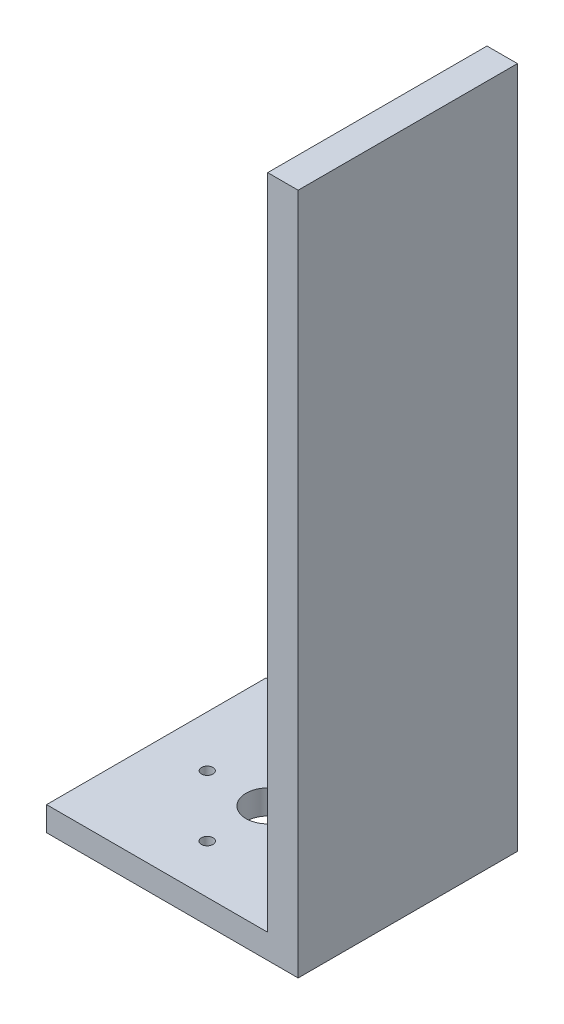
ISO-10303-21;
HEADER;
FILE_DESCRIPTION(('STEP AP214'),'2;1');
FILE_NAME('part.step','',(''),(''),'','','');
FILE_SCHEMA(('AUTOMOTIVE_DESIGN { 1 0 10303 214 1 1 1 1 }'));
ENDSEC;
DATA;
#1=APPLICATION_CONTEXT('core data for automotive mechanical design processes');
#2=APPLICATION_PROTOCOL_DEFINITION('international standard','automotive_design',2000,#1);
#3=PRODUCT_CONTEXT('',#1,'mechanical');
#4=PRODUCT('Part','Part','',(#3));
#5=PRODUCT_RELATED_PRODUCT_CATEGORY('part','',(#4));
#6=PRODUCT_DEFINITION_FORMATION('','',#4);
#7=PRODUCT_DEFINITION_CONTEXT('part definition',#1,'design');
#8=PRODUCT_DEFINITION('design','',#6,#7);
#9=PRODUCT_DEFINITION_SHAPE('','',#8);
#10=(LENGTH_UNIT() NAMED_UNIT(*) SI_UNIT(.MILLI.,.METRE.));
#11=(NAMED_UNIT(*) PLANE_ANGLE_UNIT() SI_UNIT($,.RADIAN.));
#12=(NAMED_UNIT(*) SI_UNIT($,.STERADIAN.) SOLID_ANGLE_UNIT());
#13=UNCERTAINTY_MEASURE_WITH_UNIT(LENGTH_MEASURE(1.E-05),#10,'distance_accuracy_value','');
#14=(GEOMETRIC_REPRESENTATION_CONTEXT(3) GLOBAL_UNCERTAINTY_ASSIGNED_CONTEXT((#13)) GLOBAL_UNIT_ASSIGNED_CONTEXT((#10,
#11,#12)) REPRESENTATION_CONTEXT('',''));
#15=CARTESIAN_POINT('',(0.,0.,0.));
#16=DIRECTION('',(0.,0.,1.));
#17=DIRECTION('',(1.,0.,0.));
#18=AXIS2_PLACEMENT_3D('',#15,#16,#17);
#19=CARTESIAN_POINT('',(0.,10.,0.));
#20=DIRECTION('',(0.,1.,0.));
#21=DIRECTION('',(0.,0.,1.));
#22=AXIS2_PLACEMENT_3D('',#19,#20,#21);
#23=PLANE('',#22);
#24=DIRECTION('',(0.,0.,1.));
#25=VECTOR('',#24,1.);
#26=CARTESIAN_POINT('',(-51.924074706364,10.,45.));
#27=LINE('',#26,#25);
#28=CARTESIAN_POINT('',(-51.924074706364,10.,-45.));
#29=VERTEX_POINT('',#28);
#30=CARTESIAN_POINT('',(-51.924074706364,10.,45.));
#31=VERTEX_POINT('',#30);
#32=EDGE_CURVE('E176',#29,#31,#27,.T.);
#33=ORIENTED_EDGE('',*,*,#32,.T.);
#34=DIRECTION('',(1.,0.,0.));
#35=VECTOR('',#34,1.);
#36=CARTESIAN_POINT('',(-200.,10.,45.));
#37=LINE('',#36,#35);
#38=CARTESIAN_POINT('',(38.823966942914,10.,45.));
#39=VERTEX_POINT('',#38);
#40=EDGE_CURVE('E11',#31,#39,#37,.T.);
#41=ORIENTED_EDGE('',*,*,#40,.T.);
#42=DIRECTION('',(0.,0.,1.));
#43=VECTOR('',#42,1.);
#44=CARTESIAN_POINT('',(38.823966942914,10.,-45.));
#45=LINE('',#44,#43);
#46=CARTESIAN_POINT('',(38.823966942914,10.,-45.));
#47=VERTEX_POINT('',#46);
#48=EDGE_CURVE('E155',#47,#39,#45,.T.);
#49=ORIENTED_EDGE('',*,*,#48,.F.);
#50=DIRECTION('',(-1.,0.,0.));
#51=VECTOR('',#50,1.);
#52=CARTESIAN_POINT('',(-200.,10.,-45.));
#53=LINE('',#52,#51);
#54=EDGE_CURVE('E46',#47,#29,#53,.T.);
#55=ORIENTED_EDGE('',*,*,#54,.T.);
#56=EDGE_LOOP('',(#33,#41,#49,#55));
#57=FACE_BOUND('',#56,.T.);
#58=CARTESIAN_POINT('',(-5.99999999999978,10.,0.));
#59=DIRECTION('',(0.,1.,0.));
#60=DIRECTION('',(0.,0.,1.));
#61=AXIS2_PLACEMENT_3D('',#58,#59,#60);
#62=CIRCLE('',#61,9.06315243165887);
#63=CARTESIAN_POINT('',(-5.99999999999978,10.,9.06315243165887));
#64=VERTEX_POINT('',#63);
#65=EDGE_CURVE('E115',#64,#64,#62,.T.);
#66=ORIENTED_EDGE('',*,*,#65,.F.);
#67=EDGE_LOOP('',(#66));
#68=FACE_BOUND('',#67,.T.);
#69=CARTESIAN_POINT('',(-5.99999999999978,10.,-25.));
#70=DIRECTION('',(0.,1.,0.));
#71=DIRECTION('',(0.,0.,1.));
#72=AXIS2_PLACEMENT_3D('',#69,#70,#71);
#73=CIRCLE('',#72,1.81023823001238);
#74=CARTESIAN_POINT('',(-5.99999999999978,10.,-23.1897617699876));
#75=VERTEX_POINT('',#74);
#76=EDGE_CURVE('E127',#75,#75,#73,.T.);
#77=ORIENTED_EDGE('',*,*,#76,.F.);
#78=EDGE_LOOP('',(#77));
#79=FACE_BOUND('',#78,.T.);
#80=CARTESIAN_POINT('',(19.0000000000002,10.,0.));
#81=DIRECTION('',(0.,1.,0.));
#82=DIRECTION('',(0.,0.,1.));
#83=AXIS2_PLACEMENT_3D('',#80,#81,#82);
#84=CIRCLE('',#83,1.95437308530415);
#85=CARTESIAN_POINT('',(19.0000000000002,10.,1.95437308530415));
#86=VERTEX_POINT('',#85);
#87=EDGE_CURVE('E133',#86,#86,#84,.T.);
#88=ORIENTED_EDGE('',*,*,#87,.F.);
#89=EDGE_LOOP('',(#88));
#90=FACE_BOUND('',#89,.T.);
#91=CARTESIAN_POINT('',(-5.99999999999978,10.,25.));
#92=DIRECTION('',(0.,1.,0.));
#93=DIRECTION('',(0.,0.,1.));
#94=AXIS2_PLACEMENT_3D('',#91,#92,#93);
#95=CIRCLE('',#94,2.39991115719557);
#96=CARTESIAN_POINT('',(-5.99999999999978,10.,27.3999111571956));
#97=VERTEX_POINT('',#96);
#98=EDGE_CURVE('E139',#97,#97,#95,.T.);
#99=ORIENTED_EDGE('',*,*,#98,.F.);
#100=EDGE_LOOP('',(#99));
#101=FACE_BOUND('',#100,.T.);
#102=CARTESIAN_POINT('',(-30.9999999999998,10.,0.));
#103=DIRECTION('',(0.,1.,0.));
#104=DIRECTION('',(0.,0.,1.));
#105=AXIS2_PLACEMENT_3D('',#102,#103,#104);
#106=CIRCLE('',#105,2.35990683865569);
#107=CARTESIAN_POINT('',(-30.9999999999998,10.,2.35990683865569));
#108=VERTEX_POINT('',#107);
#109=EDGE_CURVE('E145',#108,#108,#106,.T.);
#110=ORIENTED_EDGE('',*,*,#109,.F.);
#111=EDGE_LOOP('',(#110));
#112=FACE_BOUND('',#111,.T.);
#113=ADVANCED_FACE('F37',(#57,#68,#79,#90,#101,#112),#23,.T.);
#114=CARTESIAN_POINT('',(-200.,10.,-45.));
#115=DIRECTION('',(0.,0.,1.));
#116=DIRECTION('',(1.,0.,0.));
#117=AXIS2_PLACEMENT_3D('',#114,#115,#116);
#118=PLANE('',#117);
#119=DIRECTION('',(0.,-1.,0.));
#120=VECTOR('',#119,1.);
#121=CARTESIAN_POINT('',(51.3237949027427,280.,-45.));
#122=LINE('',#121,#120);
#123=CARTESIAN_POINT('',(51.3237949027427,280.,-45.));
#124=VERTEX_POINT('',#123);
#125=CARTESIAN_POINT('',(51.3237949027427,0.,-45.));
#126=VERTEX_POINT('',#125);
#127=EDGE_CURVE('E90',#124,#126,#122,.T.);
#128=ORIENTED_EDGE('',*,*,#127,.T.);
#129=DIRECTION('',(-1.,0.,0.));
#130=VECTOR('',#129,1.);
#131=CARTESIAN_POINT('',(-200.,0.,-45.));
#132=LINE('',#131,#130);
#133=CARTESIAN_POINT('',(-51.924074706364,0.,-45.));
#134=VERTEX_POINT('',#133);
#135=EDGE_CURVE('E53',#126,#134,#132,.T.);
#136=ORIENTED_EDGE('',*,*,#135,.T.);
#137=DIRECTION('',(0.,-1.,0.));
#138=VECTOR('',#137,1.);
#139=CARTESIAN_POINT('',(-51.924074706364,10.,-45.));
#140=LINE('',#139,#138);
#141=EDGE_CURVE('E174',#29,#134,#140,.T.);
#142=ORIENTED_EDGE('',*,*,#141,.F.);
#143=ORIENTED_EDGE('',*,*,#54,.F.);
#144=DIRECTION('',(0.,-1.,0.));
#145=VECTOR('',#144,1.);
#146=CARTESIAN_POINT('',(38.823966942914,280.,-45.));
#147=LINE('',#146,#145);
#148=CARTESIAN_POINT('',(38.823966942914,280.,-45.));
#149=VERTEX_POINT('',#148);
#150=EDGE_CURVE('E97',#149,#47,#147,.T.);
#151=ORIENTED_EDGE('',*,*,#150,.F.);
#152=DIRECTION('',(-1.,0.,0.));
#153=VECTOR('',#152,1.);
#154=CARTESIAN_POINT('',(38.823966942914,280.,-45.));
#155=LINE('',#154,#153);
#156=EDGE_CURVE('E93',#124,#149,#155,.T.);
#157=ORIENTED_EDGE('',*,*,#156,.F.);
#158=EDGE_LOOP('',(#128,#136,#142,#143,#151,#157));
#159=FACE_BOUND('',#158,.T.);
#160=ADVANCED_FACE('F39',(#159),#118,.F.);
#161=CARTESIAN_POINT('',(-200.,10.,45.));
#162=DIRECTION('',(0.,0.,-1.));
#163=DIRECTION('',(-1.,0.,0.));
#164=AXIS2_PLACEMENT_3D('',#161,#162,#163);
#165=PLANE('',#164);
#166=DIRECTION('',(1.,0.,0.));
#167=VECTOR('',#166,1.);
#168=CARTESIAN_POINT('',(-200.,0.,45.));
#169=LINE('',#168,#167);
#170=CARTESIAN_POINT('',(-51.924074706364,0.,45.));
#171=VERTEX_POINT('',#170);
#172=CARTESIAN_POINT('',(51.3237949027427,0.,45.));
#173=VERTEX_POINT('',#172);
#174=EDGE_CURVE('E110',#171,#173,#169,.T.);
#175=ORIENTED_EDGE('',*,*,#174,.T.);
#176=DIRECTION('',(0.,-1.,0.));
#177=VECTOR('',#176,1.);
#178=CARTESIAN_POINT('',(51.3237949027427,280.,45.));
#179=LINE('',#178,#177);
#180=CARTESIAN_POINT('',(51.3237949027427,280.,45.));
#181=VERTEX_POINT('',#180);
#182=EDGE_CURVE('E96',#181,#173,#179,.T.);
#183=ORIENTED_EDGE('',*,*,#182,.F.);
#184=DIRECTION('',(1.,0.,0.));
#185=VECTOR('',#184,1.);
#186=CARTESIAN_POINT('',(38.823966942914,280.,45.));
#187=LINE('',#186,#185);
#188=CARTESIAN_POINT('',(38.823966942914,280.,45.));
#189=VERTEX_POINT('',#188);
#190=EDGE_CURVE('E170',#189,#181,#187,.T.);
#191=ORIENTED_EDGE('',*,*,#190,.F.);
#192=DIRECTION('',(0.,-1.,0.));
#193=VECTOR('',#192,1.);
#194=CARTESIAN_POINT('',(38.823966942914,280.,45.));
#195=LINE('',#194,#193);
#196=EDGE_CURVE('E148',#189,#39,#195,.T.);
#197=ORIENTED_EDGE('',*,*,#196,.T.);
#198=ORIENTED_EDGE('',*,*,#40,.F.);
#199=DIRECTION('',(0.,-1.,0.));
#200=VECTOR('',#199,1.);
#201=CARTESIAN_POINT('',(-51.924074706364,10.,45.));
#202=LINE('',#201,#200);
#203=EDGE_CURVE('E160',#31,#171,#202,.T.);
#204=ORIENTED_EDGE('',*,*,#203,.T.);
#205=EDGE_LOOP('',(#175,#183,#191,#197,#198,#204));
#206=FACE_BOUND('',#205,.T.);
#207=ADVANCED_FACE('F184',(#206),#165,.F.);
#208=CARTESIAN_POINT('',(0.,0.,0.));
#209=DIRECTION('',(0.,1.,0.));
#210=DIRECTION('',(0.,0.,1.));
#211=AXIS2_PLACEMENT_3D('',#208,#209,#210);
#212=PLANE('',#211);
#213=CARTESIAN_POINT('',(-30.9999999999998,0.,0.));
#214=DIRECTION('',(0.,1.,0.));
#215=DIRECTION('',(0.,0.,1.));
#216=AXIS2_PLACEMENT_3D('',#213,#214,#215);
#217=CIRCLE('',#216,2.35990683865569);
#218=CARTESIAN_POINT('',(-30.9999999999998,0.,2.35990683865569));
#219=VERTEX_POINT('',#218);
#220=EDGE_CURVE('E142',#219,#219,#217,.T.);
#221=ORIENTED_EDGE('',*,*,#220,.T.);
#222=EDGE_LOOP('',(#221));
#223=FACE_BOUND('',#222,.T.);
#224=CARTESIAN_POINT('',(-5.99999999999978,0.,25.));
#225=DIRECTION('',(0.,1.,0.));
#226=DIRECTION('',(0.,0.,1.));
#227=AXIS2_PLACEMENT_3D('',#224,#225,#226);
#228=CIRCLE('',#227,2.39991115719557);
#229=CARTESIAN_POINT('',(-5.99999999999978,0.,27.3999111571956));
#230=VERTEX_POINT('',#229);
#231=EDGE_CURVE('E136',#230,#230,#228,.T.);
#232=ORIENTED_EDGE('',*,*,#231,.T.);
#233=EDGE_LOOP('',(#232));
#234=FACE_BOUND('',#233,.T.);
#235=CARTESIAN_POINT('',(19.0000000000002,0.,0.));
#236=DIRECTION('',(0.,1.,0.));
#237=DIRECTION('',(0.,0.,1.));
#238=AXIS2_PLACEMENT_3D('',#235,#236,#237);
#239=CIRCLE('',#238,1.95437308530415);
#240=CARTESIAN_POINT('',(19.0000000000002,0.,1.95437308530415));
#241=VERTEX_POINT('',#240);
#242=EDGE_CURVE('E130',#241,#241,#239,.T.);
#243=ORIENTED_EDGE('',*,*,#242,.T.);
#244=EDGE_LOOP('',(#243));
#245=FACE_BOUND('',#244,.T.);
#246=CARTESIAN_POINT('',(-5.99999999999978,0.,-25.));
#247=DIRECTION('',(0.,1.,0.));
#248=DIRECTION('',(0.,0.,1.));
#249=AXIS2_PLACEMENT_3D('',#246,#247,#248);
#250=CIRCLE('',#249,1.81023823001238);
#251=CARTESIAN_POINT('',(-5.99999999999978,0.,-23.1897617699876));
#252=VERTEX_POINT('',#251);
#253=EDGE_CURVE('E125',#252,#252,#250,.T.);
#254=ORIENTED_EDGE('',*,*,#253,.T.);
#255=EDGE_LOOP('',(#254));
#256=FACE_BOUND('',#255,.T.);
#257=CARTESIAN_POINT('',(-5.99999999999978,0.,0.));
#258=DIRECTION('',(0.,1.,0.));
#259=DIRECTION('',(0.,0.,1.));
#260=AXIS2_PLACEMENT_3D('',#257,#258,#259);
#261=CIRCLE('',#260,9.06315243165887);
#262=CARTESIAN_POINT('',(-5.99999999999978,0.,9.06315243165887));
#263=VERTEX_POINT('',#262);
#264=EDGE_CURVE('E111',#263,#263,#261,.T.);
#265=ORIENTED_EDGE('',*,*,#264,.T.);
#266=EDGE_LOOP('',(#265));
#267=FACE_BOUND('',#266,.T.);
#268=ORIENTED_EDGE('',*,*,#135,.F.);
#269=DIRECTION('',(0.,0.,1.));
#270=VECTOR('',#269,1.);
#271=CARTESIAN_POINT('',(51.3237949027427,0.,-45.));
#272=LINE('',#271,#270);
#273=EDGE_CURVE('E100',#126,#173,#272,.T.);
#274=ORIENTED_EDGE('',*,*,#273,.T.);
#275=ORIENTED_EDGE('',*,*,#174,.F.);
#276=DIRECTION('',(0.,0.,1.));
#277=VECTOR('',#276,1.);
#278=CARTESIAN_POINT('',(-51.924074706364,0.,45.));
#279=LINE('',#278,#277);
#280=EDGE_CURVE('E106',#134,#171,#279,.T.);
#281=ORIENTED_EDGE('',*,*,#280,.F.);
#282=EDGE_LOOP('',(#268,#274,#275,#281));
#283=FACE_BOUND('',#282,.T.);
#284=ADVANCED_FACE('F109',(#223,#234,#245,#256,#267,#283),#212,.F.);
#285=CARTESIAN_POINT('',(-5.99999999999978,0.,0.));
#286=DIRECTION('',(0.,1.,0.));
#287=DIRECTION('',(0.,0.,1.));
#288=AXIS2_PLACEMENT_3D('',#285,#286,#287);
#289=CYLINDRICAL_SURFACE('',#288,9.06315243165887);
#290=ORIENTED_EDGE('',*,*,#264,.F.);
#291=EDGE_LOOP('',(#290));
#292=FACE_BOUND('',#291,.T.);
#293=ORIENTED_EDGE('',*,*,#65,.T.);
#294=EDGE_LOOP('',(#293));
#295=FACE_BOUND('',#294,.T.);
#296=ADVANCED_FACE('F203',(#292,#295),#289,.F.);
#297=CARTESIAN_POINT('',(-5.99999999999978,0.,-25.));
#298=DIRECTION('',(0.,1.,0.));
#299=DIRECTION('',(0.,0.,1.));
#300=AXIS2_PLACEMENT_3D('',#297,#298,#299);
#301=CYLINDRICAL_SURFACE('',#300,1.81023823001238);
#302=ORIENTED_EDGE('',*,*,#253,.F.);
#303=EDGE_LOOP('',(#302));
#304=FACE_BOUND('',#303,.T.);
#305=ORIENTED_EDGE('',*,*,#76,.T.);
#306=EDGE_LOOP('',(#305));
#307=FACE_BOUND('',#306,.T.);
#308=ADVANCED_FACE('F271',(#304,#307),#301,.F.);
#309=CARTESIAN_POINT('',(19.0000000000002,0.,0.));
#310=DIRECTION('',(0.,1.,0.));
#311=DIRECTION('',(0.,0.,1.));
#312=AXIS2_PLACEMENT_3D('',#309,#310,#311);
#313=CYLINDRICAL_SURFACE('',#312,1.95437308530415);
#314=ORIENTED_EDGE('',*,*,#242,.F.);
#315=EDGE_LOOP('',(#314));
#316=FACE_BOUND('',#315,.T.);
#317=ORIENTED_EDGE('',*,*,#87,.T.);
#318=EDGE_LOOP('',(#317));
#319=FACE_BOUND('',#318,.T.);
#320=ADVANCED_FACE('F279',(#316,#319),#313,.F.);
#321=CARTESIAN_POINT('',(-5.99999999999978,0.,25.));
#322=DIRECTION('',(0.,1.,0.));
#323=DIRECTION('',(0.,0.,1.));
#324=AXIS2_PLACEMENT_3D('',#321,#322,#323);
#325=CYLINDRICAL_SURFACE('',#324,2.39991115719557);
#326=ORIENTED_EDGE('',*,*,#231,.F.);
#327=EDGE_LOOP('',(#326));
#328=FACE_BOUND('',#327,.T.);
#329=ORIENTED_EDGE('',*,*,#98,.T.);
#330=EDGE_LOOP('',(#329));
#331=FACE_BOUND('',#330,.T.);
#332=ADVANCED_FACE('F287',(#328,#331),#325,.F.);
#333=CARTESIAN_POINT('',(-30.9999999999998,0.,0.));
#334=DIRECTION('',(0.,1.,0.));
#335=DIRECTION('',(0.,0.,1.));
#336=AXIS2_PLACEMENT_3D('',#333,#334,#335);
#337=CYLINDRICAL_SURFACE('',#336,2.35990683865569);
#338=ORIENTED_EDGE('',*,*,#220,.F.);
#339=EDGE_LOOP('',(#338));
#340=FACE_BOUND('',#339,.T.);
#341=ORIENTED_EDGE('',*,*,#109,.T.);
#342=EDGE_LOOP('',(#341));
#343=FACE_BOUND('',#342,.T.);
#344=ADVANCED_FACE('F219',(#340,#343),#337,.F.);
#345=CARTESIAN_POINT('',(38.823966942914,280.,-45.));
#346=DIRECTION('',(1.,0.,0.));
#347=DIRECTION('',(0.,0.,-1.));
#348=AXIS2_PLACEMENT_3D('',#345,#346,#347);
#349=PLANE('',#348);
#350=ORIENTED_EDGE('',*,*,#48,.T.);
#351=ORIENTED_EDGE('',*,*,#196,.F.);
#352=DIRECTION('',(0.,0.,1.));
#353=VECTOR('',#352,1.);
#354=CARTESIAN_POINT('',(38.823966942914,280.,-45.));
#355=LINE('',#354,#353);
#356=EDGE_CURVE('E159',#149,#189,#355,.T.);
#357=ORIENTED_EDGE('',*,*,#356,.F.);
#358=ORIENTED_EDGE('',*,*,#150,.T.);
#359=EDGE_LOOP('',(#350,#351,#357,#358));
#360=FACE_BOUND('',#359,.T.);
#361=ADVANCED_FACE('F186',(#360),#349,.F.);
#362=CARTESIAN_POINT('',(51.3237949027427,280.,-45.));
#363=DIRECTION('',(-1.,0.,0.));
#364=DIRECTION('',(0.,0.,1.));
#365=AXIS2_PLACEMENT_3D('',#362,#363,#364);
#366=PLANE('',#365);
#367=ORIENTED_EDGE('',*,*,#182,.T.);
#368=ORIENTED_EDGE('',*,*,#273,.F.);
#369=ORIENTED_EDGE('',*,*,#127,.F.);
#370=DIRECTION('',(0.,0.,-1.));
#371=VECTOR('',#370,1.);
#372=CARTESIAN_POINT('',(51.3237949027427,280.,-45.));
#373=LINE('',#372,#371);
#374=EDGE_CURVE('E167',#181,#124,#373,.T.);
#375=ORIENTED_EDGE('',*,*,#374,.F.);
#376=EDGE_LOOP('',(#367,#368,#369,#375));
#377=FACE_BOUND('',#376,.T.);
#378=ADVANCED_FACE('F101',(#377),#366,.F.);
#379=CARTESIAN_POINT('',(0.,280.,0.));
#380=DIRECTION('',(0.,1.,0.));
#381=DIRECTION('',(0.,0.,1.));
#382=AXIS2_PLACEMENT_3D('',#379,#380,#381);
#383=PLANE('',#382);
#384=ORIENTED_EDGE('',*,*,#356,.T.);
#385=ORIENTED_EDGE('',*,*,#190,.T.);
#386=ORIENTED_EDGE('',*,*,#374,.T.);
#387=ORIENTED_EDGE('',*,*,#156,.T.);
#388=EDGE_LOOP('',(#384,#385,#386,#387));
#389=FACE_BOUND('',#388,.T.);
#390=ADVANCED_FACE('F189',(#389),#383,.T.);
#391=CARTESIAN_POINT('',(-51.924074706364,10.,45.));
#392=DIRECTION('',(1.,0.,0.));
#393=DIRECTION('',(0.,0.,-1.));
#394=AXIS2_PLACEMENT_3D('',#391,#392,#393);
#395=PLANE('',#394);
#396=ORIENTED_EDGE('',*,*,#280,.T.);
#397=ORIENTED_EDGE('',*,*,#203,.F.);
#398=ORIENTED_EDGE('',*,*,#32,.F.);
#399=ORIENTED_EDGE('',*,*,#141,.T.);
#400=EDGE_LOOP('',(#396,#397,#398,#399));
#401=FACE_BOUND('',#400,.T.);
#402=ADVANCED_FACE('F187',(#401),#395,.F.);
#403=CLOSED_SHELL('',(#113,#160,#207,#284,#296,#308,#320,#332,#344,#361,#378,#390,#402));
#404=MANIFOLD_SOLID_BREP('B2',#403);
#405=ADVANCED_BREP_SHAPE_REPRESENTATION('',(#18,#404),#14);
#406=SHAPE_DEFINITION_REPRESENTATION(#9,#405);
ENDSEC;
END-ISO-10303-21;
